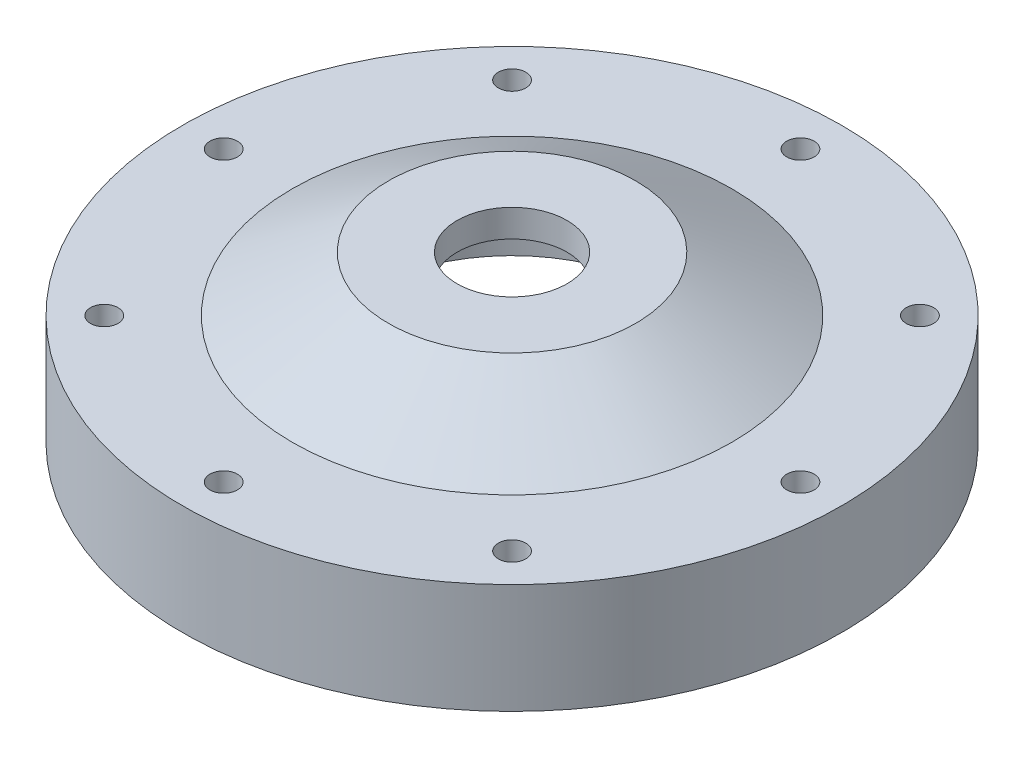
ISO-10303-21;
HEADER;
FILE_DESCRIPTION(('STEP AP214'),'2;1');
FILE_NAME('part.step','',(''),(''),'','','');
FILE_SCHEMA(('AUTOMOTIVE_DESIGN { 1 0 10303 214 1 1 1 1 }'));
ENDSEC;
DATA;
#1=APPLICATION_CONTEXT('core data for automotive mechanical design processes');
#2=APPLICATION_PROTOCOL_DEFINITION('international standard','automotive_design',2000,#1);
#3=PRODUCT_CONTEXT('',#1,'mechanical');
#4=PRODUCT('Part','Part','',(#3));
#5=PRODUCT_RELATED_PRODUCT_CATEGORY('part','',(#4));
#6=PRODUCT_DEFINITION_FORMATION('','',#4);
#7=PRODUCT_DEFINITION_CONTEXT('part definition',#1,'design');
#8=PRODUCT_DEFINITION('design','',#6,#7);
#9=PRODUCT_DEFINITION_SHAPE('','',#8);
#10=(LENGTH_UNIT() NAMED_UNIT(*) SI_UNIT(.MILLI.,.METRE.));
#11=(NAMED_UNIT(*) PLANE_ANGLE_UNIT() SI_UNIT($,.RADIAN.));
#12=(NAMED_UNIT(*) SI_UNIT($,.STERADIAN.) SOLID_ANGLE_UNIT());
#13=UNCERTAINTY_MEASURE_WITH_UNIT(LENGTH_MEASURE(1.E-05),#10,'distance_accuracy_value','');
#14=(GEOMETRIC_REPRESENTATION_CONTEXT(3) GLOBAL_UNCERTAINTY_ASSIGNED_CONTEXT((#13)) GLOBAL_UNIT_ASSIGNED_CONTEXT((#10,
#11,#12)) REPRESENTATION_CONTEXT('',''));
#15=CARTESIAN_POINT('',(0.,0.,0.));
#16=DIRECTION('',(0.,0.,1.));
#17=DIRECTION('',(1.,0.,0.));
#18=AXIS2_PLACEMENT_3D('',#15,#16,#17);
#19=CARTESIAN_POINT('',(0.,0.,0.));
#20=DIRECTION('',(0.,-1.,0.));
#21=DIRECTION('',(0.,0.,-1.));
#22=AXIS2_PLACEMENT_3D('',#19,#20,#21);
#23=CYLINDRICAL_SURFACE('',#22,12.7);
#24=CARTESIAN_POINT('',(0.,0.,0.));
#25=DIRECTION('',(0.,-1.,0.));
#26=DIRECTION('',(0.,0.,-1.));
#27=AXIS2_PLACEMENT_3D('',#24,#25,#26);
#28=CIRCLE('',#27,12.7);
#29=CARTESIAN_POINT('',(0.,0.,-12.7));
#30=VERTEX_POINT('',#29);
#31=EDGE_CURVE('E10',#30,#30,#28,.T.);
#32=ORIENTED_EDGE('',*,*,#31,.F.);
#33=EDGE_LOOP('',(#32));
#34=FACE_BOUND('',#33,.T.);
#35=CARTESIAN_POINT('',(0.,-6.35,0.));
#36=DIRECTION('',(0.,-1.,0.));
#37=DIRECTION('',(0.,0.,-1.));
#38=AXIS2_PLACEMENT_3D('',#35,#36,#37);
#39=CIRCLE('',#38,12.7);
#40=CARTESIAN_POINT('',(0.,-6.35,-12.7));
#41=VERTEX_POINT('',#40);
#42=EDGE_CURVE('E91',#41,#41,#39,.T.);
#43=ORIENTED_EDGE('',*,*,#42,.T.);
#44=EDGE_LOOP('',(#43));
#45=FACE_BOUND('',#44,.T.);
#46=ADVANCED_FACE('F37',(#34,#45),#23,.F.);
#47=CARTESIAN_POINT('',(-12.7,0.,0.));
#48=DIRECTION('',(0.,-1.,0.));
#49=DIRECTION('',(0.,0.,-1.));
#50=AXIS2_PLACEMENT_3D('',#47,#48,#49);
#51=PLANE('',#50);
#52=CARTESIAN_POINT('',(0.,0.,0.));
#53=DIRECTION('',(0.,-1.,0.));
#54=DIRECTION('',(0.,0.,-1.));
#55=AXIS2_PLACEMENT_3D('',#52,#53,#54);
#56=CIRCLE('',#55,28.575);
#57=CARTESIAN_POINT('',(0.,0.,-28.575));
#58=VERTEX_POINT('',#57);
#59=EDGE_CURVE('E44',#58,#58,#56,.T.);
#60=ORIENTED_EDGE('',*,*,#59,.F.);
#61=EDGE_LOOP('',(#60));
#62=FACE_BOUND('',#61,.T.);
#63=ORIENTED_EDGE('',*,*,#31,.T.);
#64=EDGE_LOOP('',(#63));
#65=FACE_BOUND('',#64,.T.);
#66=ADVANCED_FACE('F143',(#62,#65),#51,.F.);
#67=CARTESIAN_POINT('',(0.,0.,0.));
#68=DIRECTION('',(0.,-1.,0.));
#69=DIRECTION('',(0.,0.,-1.));
#70=AXIS2_PLACEMENT_3D('',#67,#68,#69);
#71=CONICAL_SURFACE('',#70,28.575,1.05165021254837);
#72=CARTESIAN_POINT('',(0.,-12.7,0.));
#73=DIRECTION('',(0.,-1.,0.));
#74=DIRECTION('',(0.,0.,-1.));
#75=AXIS2_PLACEMENT_3D('',#72,#73,#74);
#76=CIRCLE('',#75,50.8);
#77=CARTESIAN_POINT('',(0.,-12.7,-50.8));
#78=VERTEX_POINT('',#77);
#79=EDGE_CURVE('E49',#78,#78,#76,.T.);
#80=ORIENTED_EDGE('',*,*,#79,.F.);
#81=EDGE_LOOP('',(#80));
#82=FACE_BOUND('',#81,.T.);
#83=ORIENTED_EDGE('',*,*,#59,.T.);
#84=EDGE_LOOP('',(#83));
#85=FACE_BOUND('',#84,.T.);
#86=ADVANCED_FACE('F140',(#82,#85),#71,.T.);
#87=CARTESIAN_POINT('',(-76.2,-12.7,0.));
#88=DIRECTION('',(0.,-1.,0.));
#89=DIRECTION('',(0.,0.,-1.));
#90=AXIS2_PLACEMENT_3D('',#87,#88,#89);
#91=PLANE('',#90);
#92=CARTESIAN_POINT('',(-47.1463446356136,-12.7,47.1463446356125));
#93=DIRECTION('',(0.,-1.,0.));
#94=DIRECTION('',(0.,0.,-1.));
#95=AXIS2_PLACEMENT_3D('',#92,#93,#94);
#96=CIRCLE('',#95,3.17499999999998);
#97=CARTESIAN_POINT('',(-47.1463446356136,-12.7,43.9713446356125));
#98=VERTEX_POINT('',#97);
#99=EDGE_CURVE('E251',#98,#98,#96,.T.);
#100=ORIENTED_EDGE('',*,*,#99,.T.);
#101=EDGE_LOOP('',(#100));
#102=FACE_BOUND('',#101,.T.);
#103=CARTESIAN_POINT('',(-6.90218222268783E-13,-12.7,66.675));
#104=DIRECTION('',(0.,-1.,0.));
#105=DIRECTION('',(0.,0.,-1.));
#106=AXIS2_PLACEMENT_3D('',#103,#104,#105);
#107=CIRCLE('',#106,3.17499999999999);
#108=CARTESIAN_POINT('',(-6.90218222268783E-13,-12.7,63.5));
#109=VERTEX_POINT('',#108);
#110=EDGE_CURVE('E40',#109,#109,#107,.T.);
#111=ORIENTED_EDGE('',*,*,#110,.T.);
#112=EDGE_LOOP('',(#111));
#113=FACE_BOUND('',#112,.T.);
#114=CARTESIAN_POINT('',(47.1463446356126,-12.7,47.1463446356135));
#115=DIRECTION('',(0.,-1.,0.));
#116=DIRECTION('',(0.,0.,-1.));
#117=AXIS2_PLACEMENT_3D('',#114,#115,#116);
#118=CIRCLE('',#117,3.17499999999998);
#119=CARTESIAN_POINT('',(47.1463446356126,-12.7,43.9713446356135));
#120=VERTEX_POINT('',#119);
#121=EDGE_CURVE('E67',#120,#120,#118,.T.);
#122=ORIENTED_EDGE('',*,*,#121,.T.);
#123=EDGE_LOOP('',(#122));
#124=FACE_BOUND('',#123,.T.);
#125=CARTESIAN_POINT('',(66.675,-12.7,0.));
#126=DIRECTION('',(0.,-1.,0.));
#127=DIRECTION('',(0.,0.,-1.));
#128=AXIS2_PLACEMENT_3D('',#125,#126,#127);
#129=CIRCLE('',#128,3.17499999999998);
#130=CARTESIAN_POINT('',(66.675,-12.7,-3.17499999999999));
#131=VERTEX_POINT('',#130);
#132=EDGE_CURVE('E57',#131,#131,#129,.T.);
#133=ORIENTED_EDGE('',*,*,#132,.T.);
#134=EDGE_LOOP('',(#133));
#135=FACE_BOUND('',#134,.T.);
#136=CARTESIAN_POINT('',(47.1463446356133,-12.7,-47.1463446356128));
#137=DIRECTION('',(0.,-1.,0.));
#138=DIRECTION('',(0.,0.,-1.));
#139=AXIS2_PLACEMENT_3D('',#136,#137,#138);
#140=CIRCLE('',#139,3.17499999999999);
#141=CARTESIAN_POINT('',(47.1463446356133,-12.7,-50.3213446356128));
#142=VERTEX_POINT('',#141);
#143=EDGE_CURVE('E64',#142,#142,#140,.T.);
#144=ORIENTED_EDGE('',*,*,#143,.T.);
#145=EDGE_LOOP('',(#144));
#146=FACE_BOUND('',#145,.T.);
#147=CARTESIAN_POINT('',(2.24629185734051E-13,-12.7,-66.675));
#148=DIRECTION('',(0.,-1.,0.));
#149=DIRECTION('',(0.,0.,-1.));
#150=AXIS2_PLACEMENT_3D('',#147,#148,#149);
#151=CIRCLE('',#150,3.17499999999999);
#152=CARTESIAN_POINT('',(2.24629185734051E-13,-12.7,-69.85));
#153=VERTEX_POINT('',#152);
#154=EDGE_CURVE('E81',#153,#153,#151,.T.);
#155=ORIENTED_EDGE('',*,*,#154,.T.);
#156=EDGE_LOOP('',(#155));
#157=FACE_BOUND('',#156,.T.);
#158=CARTESIAN_POINT('',(-47.146344635613,-12.7,-47.1463446356131));
#159=DIRECTION('',(0.,-1.,0.));
#160=DIRECTION('',(0.,0.,-1.));
#161=AXIS2_PLACEMENT_3D('',#158,#159,#160);
#162=CIRCLE('',#161,3.17499999999998);
#163=CARTESIAN_POINT('',(-47.146344635613,-12.7,-50.3213446356131));
#164=VERTEX_POINT('',#163);
#165=EDGE_CURVE('E53',#164,#164,#162,.T.);
#166=ORIENTED_EDGE('',*,*,#165,.T.);
#167=EDGE_LOOP('',(#166));
#168=FACE_BOUND('',#167,.T.);
#169=CARTESIAN_POINT('',(-66.675,-12.7,0.));
#170=DIRECTION('',(0.,-1.,0.));
#171=DIRECTION('',(0.,0.,-1.));
#172=AXIS2_PLACEMENT_3D('',#169,#170,#171);
#173=CIRCLE('',#172,3.17499999999998);
#174=CARTESIAN_POINT('',(-66.675,-12.7,-3.17499999999997));
#175=VERTEX_POINT('',#174);
#176=EDGE_CURVE('E88',#175,#175,#173,.T.);
#177=ORIENTED_EDGE('',*,*,#176,.T.);
#178=EDGE_LOOP('',(#177));
#179=FACE_BOUND('',#178,.T.);
#180=CARTESIAN_POINT('',(0.,-12.7,0.));
#181=DIRECTION('',(0.,-1.,0.));
#182=DIRECTION('',(0.,0.,-1.));
#183=AXIS2_PLACEMENT_3D('',#180,#181,#182);
#184=CIRCLE('',#183,76.2);
#185=CARTESIAN_POINT('',(0.,-12.7,-76.2));
#186=VERTEX_POINT('',#185);
#187=EDGE_CURVE('E133',#186,#186,#184,.T.);
#188=ORIENTED_EDGE('',*,*,#187,.F.);
#189=EDGE_LOOP('',(#188));
#190=FACE_BOUND('',#189,.T.);
#191=ORIENTED_EDGE('',*,*,#79,.T.);
#192=EDGE_LOOP('',(#191));
#193=FACE_BOUND('',#192,.T.);
#194=ADVANCED_FACE('F138',(#102,#113,#124,#135,#146,#157,#168,#179,#190,#193),#91,.F.);
#195=CARTESIAN_POINT('',(0.,0.,0.));
#196=DIRECTION('',(0.,-1.,0.));
#197=DIRECTION('',(0.,0.,-1.));
#198=AXIS2_PLACEMENT_3D('',#195,#196,#197);
#199=CYLINDRICAL_SURFACE('',#198,76.2);
#200=CARTESIAN_POINT('',(0.,-38.1,0.));
#201=DIRECTION('',(0.,-1.,0.));
#202=DIRECTION('',(0.,0.,-1.));
#203=AXIS2_PLACEMENT_3D('',#200,#201,#202);
#204=CIRCLE('',#203,76.2);
#205=CARTESIAN_POINT('',(0.,-38.1,-76.2));
#206=VERTEX_POINT('',#205);
#207=EDGE_CURVE('E130',#206,#206,#204,.T.);
#208=ORIENTED_EDGE('',*,*,#207,.F.);
#209=EDGE_LOOP('',(#208));
#210=FACE_BOUND('',#209,.T.);
#211=ORIENTED_EDGE('',*,*,#187,.T.);
#212=EDGE_LOOP('',(#211));
#213=FACE_BOUND('',#212,.T.);
#214=ADVANCED_FACE('F155',(#210,#213),#199,.T.);
#215=CARTESIAN_POINT('',(-76.2,-38.1,0.));
#216=DIRECTION('',(0.,1.,0.));
#217=DIRECTION('',(0.,0.,1.));
#218=AXIS2_PLACEMENT_3D('',#215,#216,#217);
#219=PLANE('',#218);
#220=CARTESIAN_POINT('',(-47.1463446356136,-38.1,47.1463446356125));
#221=DIRECTION('',(0.,1.,0.));
#222=DIRECTION('',(0.,0.,1.));
#223=AXIS2_PLACEMENT_3D('',#220,#221,#222);
#224=CIRCLE('',#223,3.17499999999998);
#225=CARTESIAN_POINT('',(-47.1463446356136,-38.1,50.3213446356125));
#226=VERTEX_POINT('',#225);
#227=EDGE_CURVE('E248',#226,#226,#224,.T.);
#228=ORIENTED_EDGE('',*,*,#227,.T.);
#229=EDGE_LOOP('',(#228));
#230=FACE_BOUND('',#229,.T.);
#231=CARTESIAN_POINT('',(-6.90218222268783E-13,-38.1,66.675));
#232=DIRECTION('',(0.,1.,0.));
#233=DIRECTION('',(0.,0.,1.));
#234=AXIS2_PLACEMENT_3D('',#231,#232,#233);
#235=CIRCLE('',#234,3.17499999999998);
#236=CARTESIAN_POINT('',(-6.90218222268783E-13,-38.1,69.85));
#237=VERTEX_POINT('',#236);
#238=EDGE_CURVE('E252',#237,#237,#235,.T.);
#239=ORIENTED_EDGE('',*,*,#238,.T.);
#240=EDGE_LOOP('',(#239));
#241=FACE_BOUND('',#240,.T.);
#242=CARTESIAN_POINT('',(47.1463446356126,-38.1,47.1463446356135));
#243=DIRECTION('',(0.,1.,0.));
#244=DIRECTION('',(0.,0.,1.));
#245=AXIS2_PLACEMENT_3D('',#242,#243,#244);
#246=CIRCLE('',#245,3.17499999999998);
#247=CARTESIAN_POINT('',(47.1463446356126,-38.1,50.3213446356134));
#248=VERTEX_POINT('',#247);
#249=EDGE_CURVE('E72',#248,#248,#246,.T.);
#250=ORIENTED_EDGE('',*,*,#249,.T.);
#251=EDGE_LOOP('',(#250));
#252=FACE_BOUND('',#251,.T.);
#253=CARTESIAN_POINT('',(66.675,-38.1,0.));
#254=DIRECTION('',(0.,1.,0.));
#255=DIRECTION('',(0.,0.,1.));
#256=AXIS2_PLACEMENT_3D('',#253,#254,#255);
#257=CIRCLE('',#256,3.17499999999998);
#258=CARTESIAN_POINT('',(66.675,-38.1,3.17499999999997));
#259=VERTEX_POINT('',#258);
#260=EDGE_CURVE('E60',#259,#259,#257,.T.);
#261=ORIENTED_EDGE('',*,*,#260,.T.);
#262=EDGE_LOOP('',(#261));
#263=FACE_BOUND('',#262,.T.);
#264=CARTESIAN_POINT('',(47.1463446356133,-38.1,-47.1463446356128));
#265=DIRECTION('',(0.,1.,0.));
#266=DIRECTION('',(0.,0.,1.));
#267=AXIS2_PLACEMENT_3D('',#264,#265,#266);
#268=CIRCLE('',#267,3.17499999999998);
#269=CARTESIAN_POINT('',(47.1463446356133,-38.1,-43.9713446356128));
#270=VERTEX_POINT('',#269);
#271=EDGE_CURVE('E59',#270,#270,#268,.T.);
#272=ORIENTED_EDGE('',*,*,#271,.T.);
#273=EDGE_LOOP('',(#272));
#274=FACE_BOUND('',#273,.T.);
#275=CARTESIAN_POINT('',(2.24629185734051E-13,-38.1,-66.675));
#276=DIRECTION('',(0.,1.,0.));
#277=DIRECTION('',(0.,0.,1.));
#278=AXIS2_PLACEMENT_3D('',#275,#276,#277);
#279=CIRCLE('',#278,3.17499999999998);
#280=CARTESIAN_POINT('',(2.24629185734051E-13,-38.1,-63.5));
#281=VERTEX_POINT('',#280);
#282=EDGE_CURVE('E78',#281,#281,#279,.T.);
#283=ORIENTED_EDGE('',*,*,#282,.T.);
#284=EDGE_LOOP('',(#283));
#285=FACE_BOUND('',#284,.T.);
#286=CARTESIAN_POINT('',(-47.146344635613,-38.1,-47.1463446356131));
#287=DIRECTION('',(0.,1.,0.));
#288=DIRECTION('',(0.,0.,1.));
#289=AXIS2_PLACEMENT_3D('',#286,#287,#288);
#290=CIRCLE('',#289,3.17499999999998);
#291=CARTESIAN_POINT('',(-47.146344635613,-38.1,-43.9713446356131));
#292=VERTEX_POINT('',#291);
#293=EDGE_CURVE('E56',#292,#292,#290,.T.);
#294=ORIENTED_EDGE('',*,*,#293,.T.);
#295=EDGE_LOOP('',(#294));
#296=FACE_BOUND('',#295,.T.);
#297=CARTESIAN_POINT('',(-66.675,-38.1,0.));
#298=DIRECTION('',(0.,1.,0.));
#299=DIRECTION('',(0.,0.,1.));
#300=AXIS2_PLACEMENT_3D('',#297,#298,#299);
#301=CIRCLE('',#300,3.17499999999998);
#302=CARTESIAN_POINT('',(-66.675,-38.1,3.17499999999999));
#303=VERTEX_POINT('',#302);
#304=EDGE_CURVE('E55',#303,#303,#301,.T.);
#305=ORIENTED_EDGE('',*,*,#304,.T.);
#306=EDGE_LOOP('',(#305));
#307=FACE_BOUND('',#306,.T.);
#308=CARTESIAN_POINT('',(0.,-38.1,0.));
#309=DIRECTION('',(0.,-1.,0.));
#310=DIRECTION('',(0.,0.,-1.));
#311=AXIS2_PLACEMENT_3D('',#308,#309,#310);
#312=CIRCLE('',#311,58.3057);
#313=CARTESIAN_POINT('',(0.,-38.1,-58.3057));
#314=VERTEX_POINT('',#313);
#315=EDGE_CURVE('E127',#314,#314,#312,.T.);
#316=ORIENTED_EDGE('',*,*,#315,.F.);
#317=EDGE_LOOP('',(#316));
#318=FACE_BOUND('',#317,.T.);
#319=ORIENTED_EDGE('',*,*,#207,.T.);
#320=EDGE_LOOP('',(#319));
#321=FACE_BOUND('',#320,.T.);
#322=ADVANCED_FACE('F159',(#230,#241,#252,#263,#274,#285,#296,#307,#318,#321),#219,.F.);
#323=CARTESIAN_POINT('',(0.,0.,0.));
#324=DIRECTION('',(0.,-1.,0.));
#325=DIRECTION('',(0.,0.,-1.));
#326=AXIS2_PLACEMENT_3D('',#323,#324,#325);
#327=CYLINDRICAL_SURFACE('',#326,58.3057);
#328=CARTESIAN_POINT('',(0.,-36.068,0.));
#329=DIRECTION('',(0.,-1.,0.));
#330=DIRECTION('',(0.,0.,-1.));
#331=AXIS2_PLACEMENT_3D('',#328,#329,#330);
#332=CIRCLE('',#331,58.3057);
#333=CARTESIAN_POINT('',(0.,-36.068,-58.3057));
#334=VERTEX_POINT('',#333);
#335=EDGE_CURVE('E124',#334,#334,#332,.T.);
#336=ORIENTED_EDGE('',*,*,#335,.F.);
#337=EDGE_LOOP('',(#336));
#338=FACE_BOUND('',#337,.T.);
#339=ORIENTED_EDGE('',*,*,#315,.T.);
#340=EDGE_LOOP('',(#339));
#341=FACE_BOUND('',#340,.T.);
#342=ADVANCED_FACE('F163',(#338,#341),#327,.F.);
#343=CARTESIAN_POINT('',(-55.5625,-36.068,0.));
#344=DIRECTION('',(0.,1.,0.));
#345=DIRECTION('',(0.,0.,1.));
#346=AXIS2_PLACEMENT_3D('',#343,#344,#345);
#347=PLANE('',#346);
#348=CARTESIAN_POINT('',(0.,-36.068,0.));
#349=DIRECTION('',(0.,-1.,0.));
#350=DIRECTION('',(0.,0.,-1.));
#351=AXIS2_PLACEMENT_3D('',#348,#349,#350);
#352=CIRCLE('',#351,55.5625);
#353=CARTESIAN_POINT('',(0.,-36.068,-55.5625));
#354=VERTEX_POINT('',#353);
#355=EDGE_CURVE('E121',#354,#354,#352,.T.);
#356=ORIENTED_EDGE('',*,*,#355,.F.);
#357=EDGE_LOOP('',(#356));
#358=FACE_BOUND('',#357,.T.);
#359=ORIENTED_EDGE('',*,*,#335,.T.);
#360=EDGE_LOOP('',(#359));
#361=FACE_BOUND('',#360,.T.);
#362=ADVANCED_FACE('F167',(#358,#361),#347,.F.);
#363=CARTESIAN_POINT('',(0.,0.,0.));
#364=DIRECTION('',(0.,-1.,0.));
#365=DIRECTION('',(0.,0.,-1.));
#366=AXIS2_PLACEMENT_3D('',#363,#364,#365);
#367=CYLINDRICAL_SURFACE('',#366,55.5625);
#368=CARTESIAN_POINT('',(0.,-38.1,0.));
#369=DIRECTION('',(0.,-1.,0.));
#370=DIRECTION('',(0.,0.,-1.));
#371=AXIS2_PLACEMENT_3D('',#368,#369,#370);
#372=CIRCLE('',#371,55.5625);
#373=CARTESIAN_POINT('',(0.,-38.1,-55.5625));
#374=VERTEX_POINT('',#373);
#375=EDGE_CURVE('E118',#374,#374,#372,.T.);
#376=ORIENTED_EDGE('',*,*,#375,.F.);
#377=EDGE_LOOP('',(#376));
#378=FACE_BOUND('',#377,.T.);
#379=ORIENTED_EDGE('',*,*,#355,.T.);
#380=EDGE_LOOP('',(#379));
#381=FACE_BOUND('',#380,.T.);
#382=ADVANCED_FACE('F171',(#378,#381),#367,.T.);
#383=CARTESIAN_POINT('',(-53.975,-38.1,0.));
#384=DIRECTION('',(0.,1.,0.));
#385=DIRECTION('',(0.,0.,1.));
#386=AXIS2_PLACEMENT_3D('',#383,#384,#385);
#387=PLANE('',#386);
#388=CARTESIAN_POINT('',(0.,-38.1,0.));
#389=DIRECTION('',(0.,-1.,0.));
#390=DIRECTION('',(0.,0.,-1.));
#391=AXIS2_PLACEMENT_3D('',#388,#389,#390);
#392=CIRCLE('',#391,53.975);
#393=CARTESIAN_POINT('',(0.,-38.1,-53.975));
#394=VERTEX_POINT('',#393);
#395=EDGE_CURVE('E115',#394,#394,#392,.T.);
#396=ORIENTED_EDGE('',*,*,#395,.F.);
#397=EDGE_LOOP('',(#396));
#398=FACE_BOUND('',#397,.T.);
#399=ORIENTED_EDGE('',*,*,#375,.T.);
#400=EDGE_LOOP('',(#399));
#401=FACE_BOUND('',#400,.T.);
#402=ADVANCED_FACE('F175',(#398,#401),#387,.F.);
#403=CARTESIAN_POINT('',(0.,0.,0.));
#404=DIRECTION('',(0.,-1.,0.));
#405=DIRECTION('',(0.,0.,-1.));
#406=AXIS2_PLACEMENT_3D('',#403,#404,#405);
#407=CYLINDRICAL_SURFACE('',#406,53.975);
#408=CARTESIAN_POINT('',(0.,-25.4,0.));
#409=DIRECTION('',(0.,-1.,0.));
#410=DIRECTION('',(0.,0.,-1.));
#411=AXIS2_PLACEMENT_3D('',#408,#409,#410);
#412=CIRCLE('',#411,53.975);
#413=CARTESIAN_POINT('',(0.,-25.4,-53.975));
#414=VERTEX_POINT('',#413);
#415=EDGE_CURVE('E112',#414,#414,#412,.T.);
#416=ORIENTED_EDGE('',*,*,#415,.F.);
#417=EDGE_LOOP('',(#416));
#418=FACE_BOUND('',#417,.T.);
#419=ORIENTED_EDGE('',*,*,#395,.T.);
#420=EDGE_LOOP('',(#419));
#421=FACE_BOUND('',#420,.T.);
#422=ADVANCED_FACE('F179',(#418,#421),#407,.F.);
#423=CARTESIAN_POINT('',(-39.2557,-25.4,0.));
#424=DIRECTION('',(0.,1.,0.));
#425=DIRECTION('',(0.,0.,1.));
#426=AXIS2_PLACEMENT_3D('',#423,#424,#425);
#427=PLANE('',#426);
#428=CARTESIAN_POINT('',(0.,-25.4,0.));
#429=DIRECTION('',(0.,-1.,0.));
#430=DIRECTION('',(0.,0.,-1.));
#431=AXIS2_PLACEMENT_3D('',#428,#429,#430);
#432=CIRCLE('',#431,39.2557);
#433=CARTESIAN_POINT('',(0.,-25.4,-39.2557));
#434=VERTEX_POINT('',#433);
#435=EDGE_CURVE('E109',#434,#434,#432,.T.);
#436=ORIENTED_EDGE('',*,*,#435,.F.);
#437=EDGE_LOOP('',(#436));
#438=FACE_BOUND('',#437,.T.);
#439=ORIENTED_EDGE('',*,*,#415,.T.);
#440=EDGE_LOOP('',(#439));
#441=FACE_BOUND('',#440,.T.);
#442=ADVANCED_FACE('F183',(#438,#441),#427,.F.);
#443=CARTESIAN_POINT('',(0.,0.,0.));
#444=DIRECTION('',(0.,-1.,0.));
#445=DIRECTION('',(0.,0.,-1.));
#446=AXIS2_PLACEMENT_3D('',#443,#444,#445);
#447=CYLINDRICAL_SURFACE('',#446,39.2557);
#448=CARTESIAN_POINT('',(0.,-23.368,0.));
#449=DIRECTION('',(0.,-1.,0.));
#450=DIRECTION('',(0.,0.,-1.));
#451=AXIS2_PLACEMENT_3D('',#448,#449,#450);
#452=CIRCLE('',#451,39.2557);
#453=CARTESIAN_POINT('',(0.,-23.368,-39.2557));
#454=VERTEX_POINT('',#453);
#455=EDGE_CURVE('E106',#454,#454,#452,.T.);
#456=ORIENTED_EDGE('',*,*,#455,.F.);
#457=EDGE_LOOP('',(#456));
#458=FACE_BOUND('',#457,.T.);
#459=ORIENTED_EDGE('',*,*,#435,.T.);
#460=EDGE_LOOP('',(#459));
#461=FACE_BOUND('',#460,.T.);
#462=ADVANCED_FACE('F187',(#458,#461),#447,.F.);
#463=CARTESIAN_POINT('',(-36.5125,-23.368,0.));
#464=DIRECTION('',(0.,1.,0.));
#465=DIRECTION('',(0.,0.,1.));
#466=AXIS2_PLACEMENT_3D('',#463,#464,#465);
#467=PLANE('',#466);
#468=CARTESIAN_POINT('',(0.,-23.368,0.));
#469=DIRECTION('',(0.,-1.,0.));
#470=DIRECTION('',(0.,0.,-1.));
#471=AXIS2_PLACEMENT_3D('',#468,#469,#470);
#472=CIRCLE('',#471,36.5125);
#473=CARTESIAN_POINT('',(0.,-23.368,-36.5125));
#474=VERTEX_POINT('',#473);
#475=EDGE_CURVE('E103',#474,#474,#472,.T.);
#476=ORIENTED_EDGE('',*,*,#475,.F.);
#477=EDGE_LOOP('',(#476));
#478=FACE_BOUND('',#477,.T.);
#479=ORIENTED_EDGE('',*,*,#455,.T.);
#480=EDGE_LOOP('',(#479));
#481=FACE_BOUND('',#480,.T.);
#482=ADVANCED_FACE('F191',(#478,#481),#467,.F.);
#483=CARTESIAN_POINT('',(0.,0.,0.));
#484=DIRECTION('',(0.,-1.,0.));
#485=DIRECTION('',(0.,0.,-1.));
#486=AXIS2_PLACEMENT_3D('',#483,#484,#485);
#487=CYLINDRICAL_SURFACE('',#486,36.5125);
#488=CARTESIAN_POINT('',(0.,-25.4,0.));
#489=DIRECTION('',(0.,-1.,0.));
#490=DIRECTION('',(0.,0.,-1.));
#491=AXIS2_PLACEMENT_3D('',#488,#489,#490);
#492=CIRCLE('',#491,36.5125);
#493=CARTESIAN_POINT('',(0.,-25.4,-36.5125));
#494=VERTEX_POINT('',#493);
#495=EDGE_CURVE('E100',#494,#494,#492,.T.);
#496=ORIENTED_EDGE('',*,*,#495,.F.);
#497=EDGE_LOOP('',(#496));
#498=FACE_BOUND('',#497,.T.);
#499=ORIENTED_EDGE('',*,*,#475,.T.);
#500=EDGE_LOOP('',(#499));
#501=FACE_BOUND('',#500,.T.);
#502=ADVANCED_FACE('F195',(#498,#501),#487,.T.);
#503=CARTESIAN_POINT('',(-36.5125,-25.4,0.));
#504=DIRECTION('',(0.,1.,0.));
#505=DIRECTION('',(0.,0.,1.));
#506=AXIS2_PLACEMENT_3D('',#503,#504,#505);
#507=PLANE('',#506);
#508=CARTESIAN_POINT('',(0.,-25.4,0.));
#509=DIRECTION('',(0.,-1.,0.));
#510=DIRECTION('',(0.,0.,-1.));
#511=AXIS2_PLACEMENT_3D('',#508,#509,#510);
#512=CIRCLE('',#511,34.925);
#513=CARTESIAN_POINT('',(0.,-25.4,-34.925));
#514=VERTEX_POINT('',#513);
#515=EDGE_CURVE('E97',#514,#514,#512,.T.);
#516=ORIENTED_EDGE('',*,*,#515,.F.);
#517=EDGE_LOOP('',(#516));
#518=FACE_BOUND('',#517,.T.);
#519=ORIENTED_EDGE('',*,*,#495,.T.);
#520=EDGE_LOOP('',(#519));
#521=FACE_BOUND('',#520,.T.);
#522=ADVANCED_FACE('F199',(#518,#521),#507,.F.);
#523=CARTESIAN_POINT('',(0.,0.,0.));
#524=DIRECTION('',(0.,-1.,0.));
#525=DIRECTION('',(0.,0.,-1.));
#526=AXIS2_PLACEMENT_3D('',#523,#524,#525);
#527=CYLINDRICAL_SURFACE('',#526,34.925);
#528=CARTESIAN_POINT('',(0.,-19.05,0.));
#529=DIRECTION('',(0.,-1.,0.));
#530=DIRECTION('',(0.,0.,-1.));
#531=AXIS2_PLACEMENT_3D('',#528,#529,#530);
#532=CIRCLE('',#531,34.925);
#533=CARTESIAN_POINT('',(0.,-19.05,-34.925));
#534=VERTEX_POINT('',#533);
#535=EDGE_CURVE('E94',#534,#534,#532,.T.);
#536=ORIENTED_EDGE('',*,*,#535,.F.);
#537=EDGE_LOOP('',(#536));
#538=FACE_BOUND('',#537,.T.);
#539=ORIENTED_EDGE('',*,*,#515,.T.);
#540=EDGE_LOOP('',(#539));
#541=FACE_BOUND('',#540,.T.);
#542=ADVANCED_FACE('F203',(#538,#541),#527,.F.);
#543=CARTESIAN_POINT('',(0.,-19.05,0.));
#544=DIRECTION('',(0.,-1.,0.));
#545=DIRECTION('',(0.,0.,-1.));
#546=AXIS2_PLACEMENT_3D('',#543,#544,#545);
#547=CONICAL_SURFACE('',#546,34.925,1.05165021254837);
#548=ORIENTED_EDGE('',*,*,#42,.F.);
#549=EDGE_LOOP('',(#548));
#550=FACE_BOUND('',#549,.T.);
#551=ORIENTED_EDGE('',*,*,#535,.T.);
#552=EDGE_LOOP('',(#551));
#553=FACE_BOUND('',#552,.T.);
#554=ADVANCED_FACE('F207',(#550,#553),#547,.F.);
#555=CARTESIAN_POINT('',(-66.675,0.,0.));
#556=DIRECTION('',(0.,1.,0.));
#557=DIRECTION('',(0.,0.,1.));
#558=AXIS2_PLACEMENT_3D('',#555,#556,#557);
#559=CYLINDRICAL_SURFACE('',#558,3.17499999999998);
#560=ORIENTED_EDGE('',*,*,#304,.F.);
#561=EDGE_LOOP('',(#560));
#562=FACE_BOUND('',#561,.T.);
#563=ORIENTED_EDGE('',*,*,#176,.F.);
#564=EDGE_LOOP('',(#563));
#565=FACE_BOUND('',#564,.T.);
#566=ADVANCED_FACE('F211',(#562,#565),#559,.F.);
#567=CARTESIAN_POINT('',(-47.146344635613,0.,-47.1463446356131));
#568=DIRECTION('',(0.,1.,0.));
#569=DIRECTION('',(0.,0.,1.));
#570=AXIS2_PLACEMENT_3D('',#567,#568,#569);
#571=CYLINDRICAL_SURFACE('',#570,3.17499999999998);
#572=ORIENTED_EDGE('',*,*,#293,.F.);
#573=EDGE_LOOP('',(#572));
#574=FACE_BOUND('',#573,.T.);
#575=ORIENTED_EDGE('',*,*,#165,.F.);
#576=EDGE_LOOP('',(#575));
#577=FACE_BOUND('',#576,.T.);
#578=ADVANCED_FACE('F215',(#574,#577),#571,.F.);
#579=CARTESIAN_POINT('',(2.24629185734051E-13,0.,-66.675));
#580=DIRECTION('',(0.,1.,0.));
#581=DIRECTION('',(0.,0.,1.));
#582=AXIS2_PLACEMENT_3D('',#579,#580,#581);
#583=CYLINDRICAL_SURFACE('',#582,3.17499999999999);
#584=ORIENTED_EDGE('',*,*,#282,.F.);
#585=EDGE_LOOP('',(#584));
#586=FACE_BOUND('',#585,.T.);
#587=ORIENTED_EDGE('',*,*,#154,.F.);
#588=EDGE_LOOP('',(#587));
#589=FACE_BOUND('',#588,.T.);
#590=ADVANCED_FACE('F219',(#586,#589),#583,.F.);
#591=CARTESIAN_POINT('',(47.1463446356133,0.,-47.1463446356128));
#592=DIRECTION('',(0.,1.,0.));
#593=DIRECTION('',(0.,0.,1.));
#594=AXIS2_PLACEMENT_3D('',#591,#592,#593);
#595=CYLINDRICAL_SURFACE('',#594,3.17499999999999);
#596=ORIENTED_EDGE('',*,*,#271,.F.);
#597=EDGE_LOOP('',(#596));
#598=FACE_BOUND('',#597,.T.);
#599=ORIENTED_EDGE('',*,*,#143,.F.);
#600=EDGE_LOOP('',(#599));
#601=FACE_BOUND('',#600,.T.);
#602=ADVANCED_FACE('F223',(#598,#601),#595,.F.);
#603=CARTESIAN_POINT('',(66.675,0.,0.));
#604=DIRECTION('',(0.,1.,0.));
#605=DIRECTION('',(0.,0.,1.));
#606=AXIS2_PLACEMENT_3D('',#603,#604,#605);
#607=CYLINDRICAL_SURFACE('',#606,3.17499999999998);
#608=ORIENTED_EDGE('',*,*,#260,.F.);
#609=EDGE_LOOP('',(#608));
#610=FACE_BOUND('',#609,.T.);
#611=ORIENTED_EDGE('',*,*,#132,.F.);
#612=EDGE_LOOP('',(#611));
#613=FACE_BOUND('',#612,.T.);
#614=ADVANCED_FACE('F227',(#610,#613),#607,.F.);
#615=CARTESIAN_POINT('',(47.1463446356126,0.,47.1463446356135));
#616=DIRECTION('',(0.,1.,0.));
#617=DIRECTION('',(0.,0.,1.));
#618=AXIS2_PLACEMENT_3D('',#615,#616,#617);
#619=CYLINDRICAL_SURFACE('',#618,3.17499999999998);
#620=ORIENTED_EDGE('',*,*,#249,.F.);
#621=EDGE_LOOP('',(#620));
#622=FACE_BOUND('',#621,.T.);
#623=ORIENTED_EDGE('',*,*,#121,.F.);
#624=EDGE_LOOP('',(#623));
#625=FACE_BOUND('',#624,.T.);
#626=ADVANCED_FACE('F231',(#622,#625),#619,.F.);
#627=CARTESIAN_POINT('',(-6.90218222268783E-13,0.,66.675));
#628=DIRECTION('',(0.,1.,0.));
#629=DIRECTION('',(0.,0.,1.));
#630=AXIS2_PLACEMENT_3D('',#627,#628,#629);
#631=CYLINDRICAL_SURFACE('',#630,3.17499999999999);
#632=ORIENTED_EDGE('',*,*,#238,.F.);
#633=EDGE_LOOP('',(#632));
#634=FACE_BOUND('',#633,.T.);
#635=ORIENTED_EDGE('',*,*,#110,.F.);
#636=EDGE_LOOP('',(#635));
#637=FACE_BOUND('',#636,.T.);
#638=ADVANCED_FACE('F235',(#634,#637),#631,.F.);
#639=CARTESIAN_POINT('',(-47.1463446356136,0.,47.1463446356125));
#640=DIRECTION('',(0.,1.,0.));
#641=DIRECTION('',(0.,0.,1.));
#642=AXIS2_PLACEMENT_3D('',#639,#640,#641);
#643=CYLINDRICAL_SURFACE('',#642,3.17499999999998);
#644=ORIENTED_EDGE('',*,*,#227,.F.);
#645=EDGE_LOOP('',(#644));
#646=FACE_BOUND('',#645,.T.);
#647=ORIENTED_EDGE('',*,*,#99,.F.);
#648=EDGE_LOOP('',(#647));
#649=FACE_BOUND('',#648,.T.);
#650=ADVANCED_FACE('F239',(#646,#649),#643,.F.);
#651=CLOSED_SHELL('',(#46,#66,#86,#194,#214,#322,#342,#362,#382,#402,#422,#442,#462,#482,#502,
#522,#542,#554,#566,#578,#590,#602,#614,#626,#638,#650));
#652=MANIFOLD_SOLID_BREP('B2',#651);
#653=ADVANCED_BREP_SHAPE_REPRESENTATION('',(#18,#652),#14);
#654=SHAPE_DEFINITION_REPRESENTATION(#9,#653);
ENDSEC;
END-ISO-10303-21;
